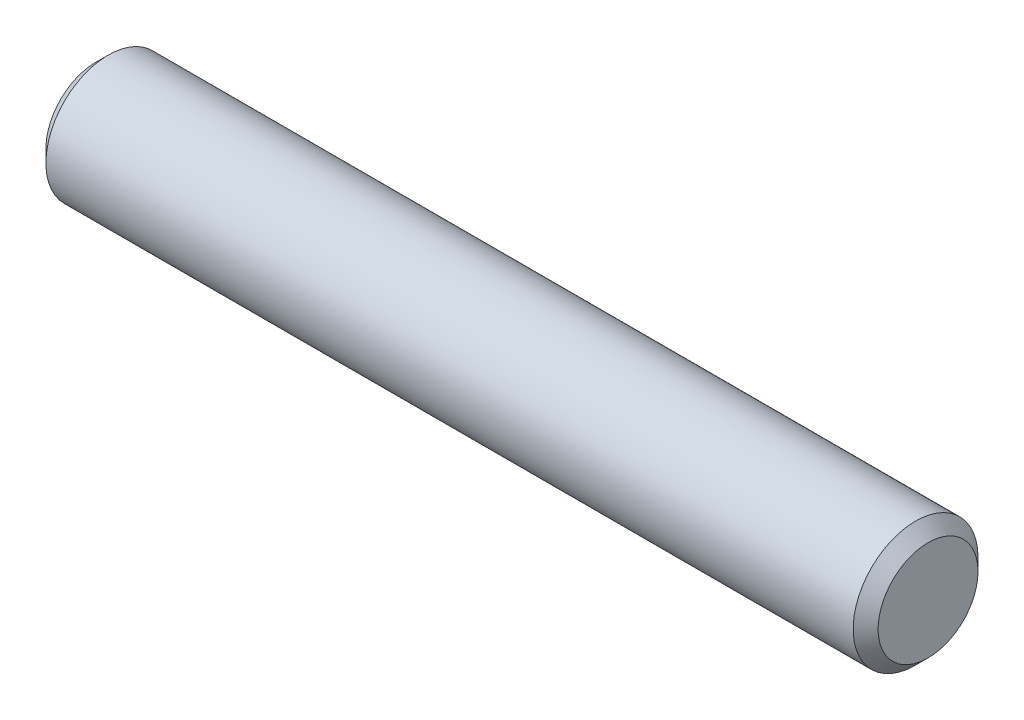
ISO-10303-21;
HEADER;
FILE_DESCRIPTION(('STEP AP214'),'2;1');
FILE_NAME('part.step','',(''),(''),'','','');
FILE_SCHEMA(('AUTOMOTIVE_DESIGN { 1 0 10303 214 1 1 1 1 }'));
ENDSEC;
DATA;
#1=APPLICATION_CONTEXT('core data for automotive mechanical design processes');
#2=APPLICATION_PROTOCOL_DEFINITION('international standard','automotive_design',2000,#1);
#3=PRODUCT_CONTEXT('',#1,'mechanical');
#4=PRODUCT('Part','Part','',(#3));
#5=PRODUCT_RELATED_PRODUCT_CATEGORY('part','',(#4));
#6=PRODUCT_DEFINITION_FORMATION('','',#4);
#7=PRODUCT_DEFINITION_CONTEXT('part definition',#1,'design');
#8=PRODUCT_DEFINITION('design','',#6,#7);
#9=PRODUCT_DEFINITION_SHAPE('','',#8);
#10=(LENGTH_UNIT() NAMED_UNIT(*) SI_UNIT(.MILLI.,.METRE.));
#11=(NAMED_UNIT(*) PLANE_ANGLE_UNIT() SI_UNIT($,.RADIAN.));
#12=(NAMED_UNIT(*) SI_UNIT($,.STERADIAN.) SOLID_ANGLE_UNIT());
#13=UNCERTAINTY_MEASURE_WITH_UNIT(LENGTH_MEASURE(1.E-05),#10,'distance_accuracy_value','');
#14=(GEOMETRIC_REPRESENTATION_CONTEXT(3) GLOBAL_UNCERTAINTY_ASSIGNED_CONTEXT((#13)) GLOBAL_UNIT_ASSIGNED_CONTEXT((#10,
#11,#12)) REPRESENTATION_CONTEXT('',''));
#15=CARTESIAN_POINT('',(0.,0.,0.));
#16=DIRECTION('',(0.,0.,1.));
#17=DIRECTION('',(1.,0.,0.));
#18=AXIS2_PLACEMENT_3D('',#15,#16,#17);
#19=CARTESIAN_POINT('',(-7.9375,0.,0.));
#20=DIRECTION('',(1.,0.,0.));
#21=DIRECTION('',(0.,0.,-1.));
#22=AXIS2_PLACEMENT_3D('',#19,#20,#21);
#23=CYLINDRICAL_SURFACE('',#22,1.190625);
#24=CARTESIAN_POINT('',(7.69937499999999,0.,0.));
#25=DIRECTION('',(1.,0.,0.));
#26=DIRECTION('',(0.,0.,-1.));
#27=AXIS2_PLACEMENT_3D('',#24,#25,#26);
#28=CIRCLE('',#27,1.190625);
#29=CARTESIAN_POINT('',(7.69937499999999,0.,-1.190625));
#30=VERTEX_POINT('',#29);
#31=EDGE_CURVE('E37',#30,#30,#28,.F.);
#32=ORIENTED_EDGE('',*,*,#31,.T.);
#33=EDGE_LOOP('',(#32));
#34=FACE_BOUND('',#33,.T.);
#35=CARTESIAN_POINT('',(-7.699375,0.,0.));
#36=DIRECTION('',(1.,0.,0.));
#37=DIRECTION('',(0.,0.,-1.));
#38=AXIS2_PLACEMENT_3D('',#35,#36,#37);
#39=CIRCLE('',#38,1.190625);
#40=CARTESIAN_POINT('',(-7.699375,0.,-1.190625));
#41=VERTEX_POINT('',#40);
#42=EDGE_CURVE('E41',#41,#41,#39,.T.);
#43=ORIENTED_EDGE('',*,*,#42,.T.);
#44=EDGE_LOOP('',(#43));
#45=FACE_BOUND('',#44,.T.);
#46=ADVANCED_FACE('F30',(#34,#45),#23,.T.);
#47=CARTESIAN_POINT('',(-7.9375,0.,0.));
#48=DIRECTION('',(1.,0.,0.));
#49=DIRECTION('',(0.,0.,-1.));
#50=AXIS2_PLACEMENT_3D('',#47,#48,#49);
#51=PLANE('',#50);
#52=CARTESIAN_POINT('',(-7.9375,0.,0.));
#53=DIRECTION('',(1.,0.,0.));
#54=DIRECTION('',(0.,0.,-1.));
#55=AXIS2_PLACEMENT_3D('',#52,#53,#54);
#56=CIRCLE('',#55,0.952499999999998);
#57=CARTESIAN_POINT('',(-7.9375,0.,-0.952499999999998));
#58=VERTEX_POINT('',#57);
#59=EDGE_CURVE('E10',#58,#58,#56,.F.);
#60=ORIENTED_EDGE('',*,*,#59,.T.);
#61=EDGE_LOOP('',(#60));
#62=FACE_BOUND('',#61,.T.);
#63=ADVANCED_FACE('F61',(#62),#51,.F.);
#64=CARTESIAN_POINT('',(7.9375,0.,0.));
#65=DIRECTION('',(1.,0.,0.));
#66=DIRECTION('',(0.,0.,-1.));
#67=AXIS2_PLACEMENT_3D('',#64,#65,#66);
#68=PLANE('',#67);
#69=CARTESIAN_POINT('',(7.9375,0.,0.));
#70=DIRECTION('',(1.,0.,0.));
#71=DIRECTION('',(0.,0.,-1.));
#72=AXIS2_PLACEMENT_3D('',#69,#70,#71);
#73=CIRCLE('',#72,0.9525);
#74=CARTESIAN_POINT('',(7.9375,0.,-0.9525));
#75=VERTEX_POINT('',#74);
#76=EDGE_CURVE('E45',#75,#75,#73,.T.);
#77=ORIENTED_EDGE('',*,*,#76,.T.);
#78=EDGE_LOOP('',(#77));
#79=FACE_BOUND('',#78,.T.);
#80=ADVANCED_FACE('F51',(#79),#68,.T.);
#81=CARTESIAN_POINT('',(7.9375,0.,0.));
#82=DIRECTION('',(-1.,0.,0.));
#83=DIRECTION('',(0.,0.,1.));
#84=AXIS2_PLACEMENT_3D('',#81,#82,#83);
#85=CONICAL_SURFACE('',#84,0.952499999999998,0.78539816339744);
#86=ORIENTED_EDGE('',*,*,#31,.F.);
#87=EDGE_LOOP('',(#86));
#88=FACE_BOUND('',#87,.T.);
#89=ORIENTED_EDGE('',*,*,#76,.F.);
#90=EDGE_LOOP('',(#89));
#91=FACE_BOUND('',#90,.T.);
#92=ADVANCED_FACE('F53',(#88,#91),#85,.T.);
#93=CARTESIAN_POINT('',(-7.699375,0.,0.));
#94=DIRECTION('',(1.,0.,0.));
#95=DIRECTION('',(0.,0.,-1.));
#96=AXIS2_PLACEMENT_3D('',#93,#94,#95);
#97=CONICAL_SURFACE('',#96,1.190625,0.785398163397447);
#98=ORIENTED_EDGE('',*,*,#59,.F.);
#99=EDGE_LOOP('',(#98));
#100=FACE_BOUND('',#99,.T.);
#101=ORIENTED_EDGE('',*,*,#42,.F.);
#102=EDGE_LOOP('',(#101));
#103=FACE_BOUND('',#102,.T.);
#104=ADVANCED_FACE('F32',(#100,#103),#97,.T.);
#105=CLOSED_SHELL('',(#46,#63,#80,#92,#104));
#106=MANIFOLD_SOLID_BREP('B2',#105);
#107=ADVANCED_BREP_SHAPE_REPRESENTATION('',(#18,#106),#14);
#108=SHAPE_DEFINITION_REPRESENTATION(#9,#107);
ENDSEC;
END-ISO-10303-21;
